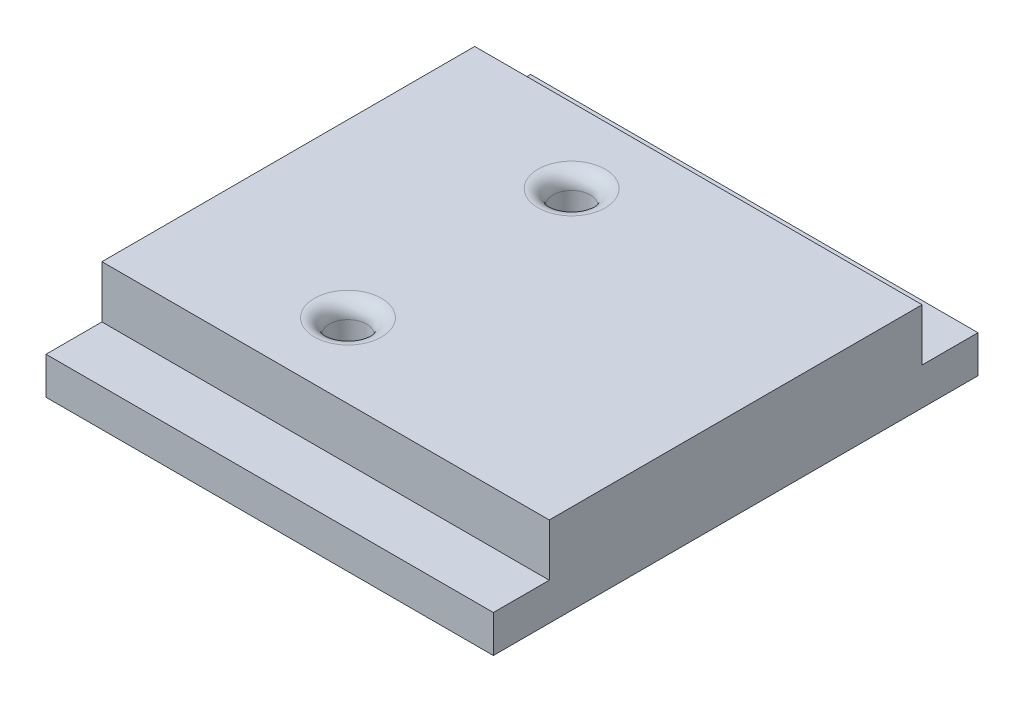
ISO-10303-21;
HEADER;
FILE_DESCRIPTION(('STEP AP214'),'2;1');
FILE_NAME('part.step','',(''),(''),'','','');
FILE_SCHEMA(('AUTOMOTIVE_DESIGN { 1 0 10303 214 1 1 1 1 }'));
ENDSEC;
DATA;
#1=APPLICATION_CONTEXT('core data for automotive mechanical design processes');
#2=APPLICATION_PROTOCOL_DEFINITION('international standard','automotive_design',2000,#1);
#3=PRODUCT_CONTEXT('',#1,'mechanical');
#4=PRODUCT('Part','Part','',(#3));
#5=PRODUCT_RELATED_PRODUCT_CATEGORY('part','',(#4));
#6=PRODUCT_DEFINITION_FORMATION('','',#4);
#7=PRODUCT_DEFINITION_CONTEXT('part definition',#1,'design');
#8=PRODUCT_DEFINITION('design','',#6,#7);
#9=PRODUCT_DEFINITION_SHAPE('','',#8);
#10=(LENGTH_UNIT() NAMED_UNIT(*) SI_UNIT(.MILLI.,.METRE.));
#11=(NAMED_UNIT(*) PLANE_ANGLE_UNIT() SI_UNIT($,.RADIAN.));
#12=(NAMED_UNIT(*) SI_UNIT($,.STERADIAN.) SOLID_ANGLE_UNIT());
#13=UNCERTAINTY_MEASURE_WITH_UNIT(LENGTH_MEASURE(1.E-05),#10,'distance_accuracy_value','');
#14=(GEOMETRIC_REPRESENTATION_CONTEXT(3) GLOBAL_UNCERTAINTY_ASSIGNED_CONTEXT((#13)) GLOBAL_UNIT_ASSIGNED_CONTEXT((#10,
#11,#12)) REPRESENTATION_CONTEXT('',''));
#15=CARTESIAN_POINT('',(0.,0.,0.));
#16=DIRECTION('',(0.,0.,1.));
#17=DIRECTION('',(1.,0.,0.));
#18=AXIS2_PLACEMENT_3D('',#15,#16,#17);
#19=CARTESIAN_POINT('',(60.,0.,0.));
#20=DIRECTION('',(0.,0.,1.));
#21=DIRECTION('',(0.,-1.,0.));
#22=AXIS2_PLACEMENT_3D('',#19,#20,#21);
#23=PLANE('',#22);
#24=DIRECTION('',(0.,1.,0.));
#25=VECTOR('',#24,1.);
#26=CARTESIAN_POINT('',(0.,0.,0.));
#27=LINE('',#26,#25);
#28=CARTESIAN_POINT('',(0.,-7.,0.));
#29=VERTEX_POINT('',#28);
#30=CARTESIAN_POINT('',(0.,0.,0.));
#31=VERTEX_POINT('',#30);
#32=EDGE_CURVE('E144',#29,#31,#27,.T.);
#33=ORIENTED_EDGE('',*,*,#32,.T.);
#34=DIRECTION('',(-1.,0.,0.));
#35=VECTOR('',#34,1.);
#36=CARTESIAN_POINT('',(60.,0.,0.));
#37=LINE('',#36,#35);
#38=CARTESIAN_POINT('',(60.,0.,0.));
#39=VERTEX_POINT('',#38);
#40=EDGE_CURVE('E186',#39,#31,#37,.T.);
#41=ORIENTED_EDGE('',*,*,#40,.F.);
#42=DIRECTION('',(0.,1.,0.));
#43=VECTOR('',#42,1.);
#44=CARTESIAN_POINT('',(60.,0.,0.));
#45=LINE('',#44,#43);
#46=CARTESIAN_POINT('',(60.,-7.,0.));
#47=VERTEX_POINT('',#46);
#48=EDGE_CURVE('E167',#47,#39,#45,.T.);
#49=ORIENTED_EDGE('',*,*,#48,.F.);
#50=DIRECTION('',(-1.,0.,0.));
#51=VECTOR('',#50,1.);
#52=CARTESIAN_POINT('',(60.,-7.,0.));
#53=LINE('',#52,#51);
#54=EDGE_CURVE('E140',#47,#29,#53,.T.);
#55=ORIENTED_EDGE('',*,*,#54,.T.);
#56=EDGE_LOOP('',(#33,#41,#49,#55));
#57=FACE_BOUND('',#56,.T.);
#58=ADVANCED_FACE('F41',(#57),#23,.F.);
#59=CARTESIAN_POINT('',(60.,0.,50.));
#60=DIRECTION('',(0.,-1.,0.));
#61=DIRECTION('',(0.,0.,-1.));
#62=AXIS2_PLACEMENT_3D('',#59,#60,#61);
#63=PLANE('',#62);
#64=CARTESIAN_POINT('',(23.,0.,40.));
#65=DIRECTION('',(0.,-1.,0.));
#66=DIRECTION('',(0.,0.,-1.));
#67=AXIS2_PLACEMENT_3D('',#64,#65,#66);
#68=CIRCLE('',#67,4.5);
#69=CARTESIAN_POINT('',(23.,0.,35.5));
#70=VERTEX_POINT('',#69);
#71=EDGE_CURVE('E193',#70,#70,#68,.T.);
#72=ORIENTED_EDGE('',*,*,#71,.T.);
#73=EDGE_LOOP('',(#72));
#74=FACE_BOUND('',#73,.T.);
#75=CARTESIAN_POINT('',(23.,0.,10.));
#76=DIRECTION('',(0.,-1.,0.));
#77=DIRECTION('',(0.,0.,-1.));
#78=AXIS2_PLACEMENT_3D('',#75,#76,#77);
#79=CIRCLE('',#78,4.5);
#80=CARTESIAN_POINT('',(23.,0.,5.5));
#81=VERTEX_POINT('',#80);
#82=EDGE_CURVE('E189',#81,#81,#79,.T.);
#83=ORIENTED_EDGE('',*,*,#82,.T.);
#84=EDGE_LOOP('',(#83));
#85=FACE_BOUND('',#84,.T.);
#86=DIRECTION('',(0.,0.,1.));
#87=VECTOR('',#86,1.);
#88=CARTESIAN_POINT('',(0.,0.,50.));
#89=LINE('',#88,#87);
#90=CARTESIAN_POINT('',(0.,0.,50.));
#91=VERTEX_POINT('',#90);
#92=EDGE_CURVE('E148',#31,#91,#89,.T.);
#93=ORIENTED_EDGE('',*,*,#92,.T.);
#94=DIRECTION('',(-1.,0.,0.));
#95=VECTOR('',#94,1.);
#96=CARTESIAN_POINT('',(60.,0.,50.));
#97=LINE('',#96,#95);
#98=CARTESIAN_POINT('',(60.,0.,50.));
#99=VERTEX_POINT('',#98);
#100=EDGE_CURVE('E182',#99,#91,#97,.T.);
#101=ORIENTED_EDGE('',*,*,#100,.F.);
#102=DIRECTION('',(0.,0.,1.));
#103=VECTOR('',#102,1.);
#104=CARTESIAN_POINT('',(60.,0.,50.));
#105=LINE('',#104,#103);
#106=EDGE_CURVE('E103',#39,#99,#105,.T.);
#107=ORIENTED_EDGE('',*,*,#106,.F.);
#108=ORIENTED_EDGE('',*,*,#40,.T.);
#109=EDGE_LOOP('',(#93,#101,#107,#108));
#110=FACE_BOUND('',#109,.T.);
#111=ADVANCED_FACE('F209',(#74,#85,#110),#63,.F.);
#112=CARTESIAN_POINT('',(60.,0.,50.));
#113=DIRECTION('',(0.,0.,-1.));
#114=DIRECTION('',(-1.,0.,0.));
#115=AXIS2_PLACEMENT_3D('',#112,#113,#114);
#116=PLANE('',#115);
#117=DIRECTION('',(0.,-1.,0.));
#118=VECTOR('',#117,1.);
#119=CARTESIAN_POINT('',(0.,0.,50.));
#120=LINE('',#119,#118);
#121=CARTESIAN_POINT('',(0.,-7.,50.));
#122=VERTEX_POINT('',#121);
#123=EDGE_CURVE('E152',#91,#122,#120,.T.);
#124=ORIENTED_EDGE('',*,*,#123,.T.);
#125=DIRECTION('',(-1.,0.,0.));
#126=VECTOR('',#125,1.);
#127=CARTESIAN_POINT('',(60.,-7.,50.));
#128=LINE('',#127,#126);
#129=CARTESIAN_POINT('',(60.,-7.,50.));
#130=VERTEX_POINT('',#129);
#131=EDGE_CURVE('E178',#130,#122,#128,.T.);
#132=ORIENTED_EDGE('',*,*,#131,.F.);
#133=DIRECTION('',(0.,-1.,0.));
#134=VECTOR('',#133,1.);
#135=CARTESIAN_POINT('',(60.,0.,50.));
#136=LINE('',#135,#134);
#137=EDGE_CURVE('E222',#99,#130,#136,.T.);
#138=ORIENTED_EDGE('',*,*,#137,.F.);
#139=ORIENTED_EDGE('',*,*,#100,.T.);
#140=EDGE_LOOP('',(#124,#132,#138,#139));
#141=FACE_BOUND('',#140,.T.);
#142=ADVANCED_FACE('F212',(#141),#116,.F.);
#143=CARTESIAN_POINT('',(60.,-7.,50.));
#144=DIRECTION('',(0.,-1.,0.));
#145=DIRECTION('',(0.,0.,-1.));
#146=AXIS2_PLACEMENT_3D('',#143,#144,#145);
#147=PLANE('',#146);
#148=DIRECTION('',(0.,0.,1.));
#149=VECTOR('',#148,1.);
#150=CARTESIAN_POINT('',(0.,-7.,50.));
#151=LINE('',#150,#149);
#152=CARTESIAN_POINT('',(0.,-7.,57.5));
#153=VERTEX_POINT('',#152);
#154=EDGE_CURVE('E155',#122,#153,#151,.T.);
#155=ORIENTED_EDGE('',*,*,#154,.T.);
#156=DIRECTION('',(-1.,0.,0.));
#157=VECTOR('',#156,1.);
#158=CARTESIAN_POINT('',(60.,-7.,57.5));
#159=LINE('',#158,#157);
#160=CARTESIAN_POINT('',(60.,-7.,57.5));
#161=VERTEX_POINT('',#160);
#162=EDGE_CURVE('E174',#161,#153,#159,.T.);
#163=ORIENTED_EDGE('',*,*,#162,.F.);
#164=DIRECTION('',(0.,0.,1.));
#165=VECTOR('',#164,1.);
#166=CARTESIAN_POINT('',(60.,-7.,50.));
#167=LINE('',#166,#165);
#168=EDGE_CURVE('E233',#130,#161,#167,.T.);
#169=ORIENTED_EDGE('',*,*,#168,.F.);
#170=ORIENTED_EDGE('',*,*,#131,.T.);
#171=EDGE_LOOP('',(#155,#163,#169,#170));
#172=FACE_BOUND('',#171,.T.);
#173=ADVANCED_FACE('F228',(#172),#147,.F.);
#174=CARTESIAN_POINT('',(60.,-7.,57.5));
#175=DIRECTION('',(0.,0.,-1.));
#176=DIRECTION('',(-1.,0.,0.));
#177=AXIS2_PLACEMENT_3D('',#174,#175,#176);
#178=PLANE('',#177);
#179=DIRECTION('',(0.,-1.,0.));
#180=VECTOR('',#179,1.);
#181=CARTESIAN_POINT('',(0.,-7.,57.5));
#182=LINE('',#181,#180);
#183=CARTESIAN_POINT('',(0.,-12.,57.5));
#184=VERTEX_POINT('',#183);
#185=EDGE_CURVE('E158',#153,#184,#182,.T.);
#186=ORIENTED_EDGE('',*,*,#185,.T.);
#187=DIRECTION('',(-1.,0.,0.));
#188=VECTOR('',#187,1.);
#189=CARTESIAN_POINT('',(60.,-12.,57.5));
#190=LINE('',#189,#188);
#191=CARTESIAN_POINT('',(60.,-12.,57.5));
#192=VERTEX_POINT('',#191);
#193=EDGE_CURVE('E133',#192,#184,#190,.T.);
#194=ORIENTED_EDGE('',*,*,#193,.F.);
#195=DIRECTION('',(0.,-1.,0.));
#196=VECTOR('',#195,1.);
#197=CARTESIAN_POINT('',(60.,-7.,57.5));
#198=LINE('',#197,#196);
#199=EDGE_CURVE('E122',#161,#192,#198,.T.);
#200=ORIENTED_EDGE('',*,*,#199,.F.);
#201=ORIENTED_EDGE('',*,*,#162,.T.);
#202=EDGE_LOOP('',(#186,#194,#200,#201));
#203=FACE_BOUND('',#202,.T.);
#204=ADVANCED_FACE('F231',(#203),#178,.F.);
#205=CARTESIAN_POINT('',(60.,-12.,57.5));
#206=DIRECTION('',(0.,1.,0.));
#207=DIRECTION('',(0.,0.,1.));
#208=AXIS2_PLACEMENT_3D('',#205,#206,#207);
#209=PLANE('',#208);
#210=CARTESIAN_POINT('',(23.,-12.,10.));
#211=DIRECTION('',(0.,1.,0.));
#212=DIRECTION('',(0.,0.,1.));
#213=AXIS2_PLACEMENT_3D('',#210,#211,#212);
#214=CIRCLE('',#213,2.5);
#215=CARTESIAN_POINT('',(23.,-12.,12.5));
#216=VERTEX_POINT('',#215);
#217=EDGE_CURVE('E149',#216,#216,#214,.T.);
#218=ORIENTED_EDGE('',*,*,#217,.T.);
#219=EDGE_LOOP('',(#218));
#220=FACE_BOUND('',#219,.T.);
#221=CARTESIAN_POINT('',(23.,-12.,40.));
#222=DIRECTION('',(0.,1.,0.));
#223=DIRECTION('',(0.,0.,1.));
#224=AXIS2_PLACEMENT_3D('',#221,#222,#223);
#225=CIRCLE('',#224,2.5);
#226=CARTESIAN_POINT('',(23.,-12.,42.5));
#227=VERTEX_POINT('',#226);
#228=EDGE_CURVE('E243',#227,#227,#225,.T.);
#229=ORIENTED_EDGE('',*,*,#228,.T.);
#230=EDGE_LOOP('',(#229));
#231=FACE_BOUND('',#230,.T.);
#232=DIRECTION('',(0.,0.,-1.));
#233=VECTOR('',#232,1.);
#234=CARTESIAN_POINT('',(0.,-12.,57.5));
#235=LINE('',#234,#233);
#236=CARTESIAN_POINT('',(0.,-12.,-7.5));
#237=VERTEX_POINT('',#236);
#238=EDGE_CURVE('E131',#184,#237,#235,.T.);
#239=ORIENTED_EDGE('',*,*,#238,.T.);
#240=DIRECTION('',(-1.,0.,0.));
#241=VECTOR('',#240,1.);
#242=CARTESIAN_POINT('',(60.,-12.,-7.5));
#243=LINE('',#242,#241);
#244=CARTESIAN_POINT('',(60.,-12.,-7.5));
#245=VERTEX_POINT('',#244);
#246=EDGE_CURVE('E128',#245,#237,#243,.T.);
#247=ORIENTED_EDGE('',*,*,#246,.F.);
#248=DIRECTION('',(0.,0.,-1.));
#249=VECTOR('',#248,1.);
#250=CARTESIAN_POINT('',(60.,-12.,57.5));
#251=LINE('',#250,#249);
#252=EDGE_CURVE('E116',#192,#245,#251,.T.);
#253=ORIENTED_EDGE('',*,*,#252,.F.);
#254=ORIENTED_EDGE('',*,*,#193,.T.);
#255=EDGE_LOOP('',(#239,#247,#253,#254));
#256=FACE_BOUND('',#255,.T.);
#257=ADVANCED_FACE('F129',(#220,#231,#256),#209,.F.);
#258=CARTESIAN_POINT('',(60.,-7.,-7.5));
#259=DIRECTION('',(0.,0.,1.));
#260=DIRECTION('',(1.,0.,0.));
#261=AXIS2_PLACEMENT_3D('',#258,#259,#260);
#262=PLANE('',#261);
#263=DIRECTION('',(0.,1.,0.));
#264=VECTOR('',#263,1.);
#265=CARTESIAN_POINT('',(0.,-7.,-7.5));
#266=LINE('',#265,#264);
#267=CARTESIAN_POINT('',(0.,-7.,-7.5));
#268=VERTEX_POINT('',#267);
#269=EDGE_CURVE('E88',#237,#268,#266,.T.);
#270=ORIENTED_EDGE('',*,*,#269,.T.);
#271=DIRECTION('',(-1.,0.,0.));
#272=VECTOR('',#271,1.);
#273=CARTESIAN_POINT('',(60.,-7.,-7.5));
#274=LINE('',#273,#272);
#275=CARTESIAN_POINT('',(60.,-7.,-7.5));
#276=VERTEX_POINT('',#275);
#277=EDGE_CURVE('E134',#276,#268,#274,.T.);
#278=ORIENTED_EDGE('',*,*,#277,.F.);
#279=DIRECTION('',(0.,1.,0.));
#280=VECTOR('',#279,1.);
#281=CARTESIAN_POINT('',(60.,-7.,-7.5));
#282=LINE('',#281,#280);
#283=EDGE_CURVE('E120',#245,#276,#282,.T.);
#284=ORIENTED_EDGE('',*,*,#283,.F.);
#285=ORIENTED_EDGE('',*,*,#246,.T.);
#286=EDGE_LOOP('',(#270,#278,#284,#285));
#287=FACE_BOUND('',#286,.T.);
#288=ADVANCED_FACE('F136',(#287),#262,.F.);
#289=CARTESIAN_POINT('',(60.,-7.,0.));
#290=DIRECTION('',(0.,-1.,0.));
#291=DIRECTION('',(0.,0.,-1.));
#292=AXIS2_PLACEMENT_3D('',#289,#290,#291);
#293=PLANE('',#292);
#294=DIRECTION('',(0.,0.,1.));
#295=VECTOR('',#294,1.);
#296=CARTESIAN_POINT('',(0.,-7.,0.));
#297=LINE('',#296,#295);
#298=EDGE_CURVE('E94',#268,#29,#297,.T.);
#299=ORIENTED_EDGE('',*,*,#298,.T.);
#300=ORIENTED_EDGE('',*,*,#54,.F.);
#301=DIRECTION('',(0.,0.,1.));
#302=VECTOR('',#301,1.);
#303=CARTESIAN_POINT('',(60.,-7.,0.));
#304=LINE('',#303,#302);
#305=EDGE_CURVE('E59',#276,#47,#304,.T.);
#306=ORIENTED_EDGE('',*,*,#305,.F.);
#307=ORIENTED_EDGE('',*,*,#277,.T.);
#308=EDGE_LOOP('',(#299,#300,#306,#307));
#309=FACE_BOUND('',#308,.T.);
#310=ADVANCED_FACE('F276',(#309),#293,.F.);
#311=CARTESIAN_POINT('',(60.,0.,0.));
#312=DIRECTION('',(1.,0.,0.));
#313=DIRECTION('',(0.,0.,-1.));
#314=AXIS2_PLACEMENT_3D('',#311,#312,#313);
#315=PLANE('',#314);
#316=ORIENTED_EDGE('',*,*,#48,.T.);
#317=ORIENTED_EDGE('',*,*,#106,.T.);
#318=ORIENTED_EDGE('',*,*,#137,.T.);
#319=ORIENTED_EDGE('',*,*,#168,.T.);
#320=ORIENTED_EDGE('',*,*,#199,.T.);
#321=ORIENTED_EDGE('',*,*,#252,.T.);
#322=ORIENTED_EDGE('',*,*,#283,.T.);
#323=ORIENTED_EDGE('',*,*,#305,.T.);
#324=EDGE_LOOP('',(#316,#317,#318,#319,#320,#321,#322,#323));
#325=FACE_BOUND('',#324,.T.);
#326=ADVANCED_FACE('F118',(#325),#315,.T.);
#327=CARTESIAN_POINT('',(0.,0.,0.));
#328=DIRECTION('',(1.,0.,0.));
#329=DIRECTION('',(0.,0.,-1.));
#330=AXIS2_PLACEMENT_3D('',#327,#328,#329);
#331=PLANE('',#330);
#332=ORIENTED_EDGE('',*,*,#32,.F.);
#333=ORIENTED_EDGE('',*,*,#298,.F.);
#334=ORIENTED_EDGE('',*,*,#269,.F.);
#335=ORIENTED_EDGE('',*,*,#238,.F.);
#336=ORIENTED_EDGE('',*,*,#185,.F.);
#337=ORIENTED_EDGE('',*,*,#154,.F.);
#338=ORIENTED_EDGE('',*,*,#123,.F.);
#339=ORIENTED_EDGE('',*,*,#92,.F.);
#340=EDGE_LOOP('',(#332,#333,#334,#335,#336,#337,#338,#339));
#341=FACE_BOUND('',#340,.T.);
#342=ADVANCED_FACE('F224',(#341),#331,.F.);
#343=CARTESIAN_POINT('',(23.,-12.,40.));
#344=DIRECTION('',(0.,1.,0.));
#345=DIRECTION('',(0.,0.,1.));
#346=AXIS2_PLACEMENT_3D('',#343,#344,#345);
#347=CYLINDRICAL_SURFACE('',#346,2.5);
#348=CARTESIAN_POINT('',(23.,-2.,40.));
#349=DIRECTION('',(0.,-1.,0.));
#350=DIRECTION('',(0.,0.,-1.));
#351=AXIS2_PLACEMENT_3D('',#348,#349,#350);
#352=CIRCLE('',#351,2.5);
#353=CARTESIAN_POINT('',(23.,-2.,37.5));
#354=VERTEX_POINT('',#353);
#355=EDGE_CURVE('E51',#354,#354,#352,.F.);
#356=ORIENTED_EDGE('',*,*,#355,.T.);
#357=EDGE_LOOP('',(#356));
#358=FACE_BOUND('',#357,.T.);
#359=ORIENTED_EDGE('',*,*,#228,.F.);
#360=EDGE_LOOP('',(#359));
#361=FACE_BOUND('',#360,.T.);
#362=ADVANCED_FACE('F200',(#358,#361),#347,.F.);
#363=CARTESIAN_POINT('',(23.,-12.,10.));
#364=DIRECTION('',(0.,1.,0.));
#365=DIRECTION('',(0.,0.,1.));
#366=AXIS2_PLACEMENT_3D('',#363,#364,#365);
#367=CYLINDRICAL_SURFACE('',#366,2.5);
#368=CARTESIAN_POINT('',(23.,-2.,10.));
#369=DIRECTION('',(0.,-1.,0.));
#370=DIRECTION('',(0.,0.,-1.));
#371=AXIS2_PLACEMENT_3D('',#368,#369,#370);
#372=CIRCLE('',#371,2.5);
#373=CARTESIAN_POINT('',(23.,-2.,7.5));
#374=VERTEX_POINT('',#373);
#375=EDGE_CURVE('E11',#374,#374,#372,.F.);
#376=ORIENTED_EDGE('',*,*,#375,.T.);
#377=EDGE_LOOP('',(#376));
#378=FACE_BOUND('',#377,.T.);
#379=ORIENTED_EDGE('',*,*,#217,.F.);
#380=EDGE_LOOP('',(#379));
#381=FACE_BOUND('',#380,.T.);
#382=ADVANCED_FACE('F206',(#378,#381),#367,.F.);
#383=CARTESIAN_POINT('',(23.,-2.,40.));
#384=DIRECTION('',(0.,-1.,0.));
#385=DIRECTION('',(0.,0.,-1.));
#386=AXIS2_PLACEMENT_3D('',#383,#384,#385);
#387=TOROIDAL_SURFACE('',#386,4.5,2.);
#388=ORIENTED_EDGE('',*,*,#355,.F.);
#389=EDGE_LOOP('',(#388));
#390=FACE_BOUND('',#389,.T.);
#391=ORIENTED_EDGE('',*,*,#71,.F.);
#392=EDGE_LOOP('',(#391));
#393=FACE_BOUND('',#392,.T.);
#394=ADVANCED_FACE('F203',(#390,#393),#387,.T.);
#395=CARTESIAN_POINT('',(23.,-2.,10.));
#396=DIRECTION('',(0.,-1.,0.));
#397=DIRECTION('',(0.,0.,-1.));
#398=AXIS2_PLACEMENT_3D('',#395,#396,#397);
#399=TOROIDAL_SURFACE('',#398,4.5,2.);
#400=ORIENTED_EDGE('',*,*,#375,.F.);
#401=EDGE_LOOP('',(#400));
#402=FACE_BOUND('',#401,.T.);
#403=ORIENTED_EDGE('',*,*,#82,.F.);
#404=EDGE_LOOP('',(#403));
#405=FACE_BOUND('',#404,.T.);
#406=ADVANCED_FACE('F43',(#402,#405),#399,.T.);
#407=CLOSED_SHELL('',(#58,#111,#142,#173,#204,#257,#288,#310,#326,#342,#362,#382,#394,#406));
#408=MANIFOLD_SOLID_BREP('B2',#407);
#409=ADVANCED_BREP_SHAPE_REPRESENTATION('',(#18,#408),#14);
#410=SHAPE_DEFINITION_REPRESENTATION(#9,#409);
ENDSEC;
END-ISO-10303-21;
